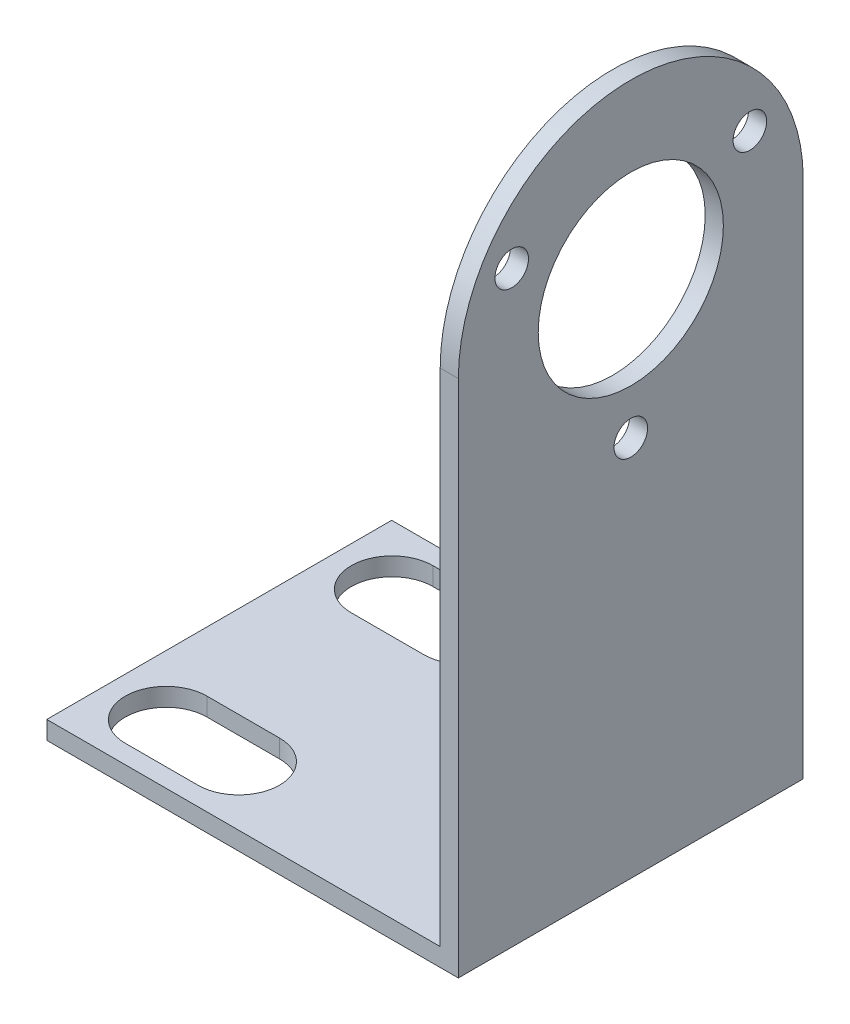
ISO-10303-21;
HEADER;
FILE_DESCRIPTION(('STEP AP214'),'2;1');
FILE_NAME('part.step','',(''),(''),'','','');
FILE_SCHEMA(('AUTOMOTIVE_DESIGN { 1 0 10303 214 1 1 1 1 }'));
ENDSEC;
DATA;
#1=APPLICATION_CONTEXT('core data for automotive mechanical design processes');
#2=APPLICATION_PROTOCOL_DEFINITION('international standard','automotive_design',2000,#1);
#3=PRODUCT_CONTEXT('',#1,'mechanical');
#4=PRODUCT('Part','Part','',(#3));
#5=PRODUCT_RELATED_PRODUCT_CATEGORY('part','',(#4));
#6=PRODUCT_DEFINITION_FORMATION('','',#4);
#7=PRODUCT_DEFINITION_CONTEXT('part definition',#1,'design');
#8=PRODUCT_DEFINITION('design','',#6,#7);
#9=PRODUCT_DEFINITION_SHAPE('','',#8);
#10=(LENGTH_UNIT() NAMED_UNIT(*) SI_UNIT(.MILLI.,.METRE.));
#11=(NAMED_UNIT(*) PLANE_ANGLE_UNIT() SI_UNIT($,.RADIAN.));
#12=(NAMED_UNIT(*) SI_UNIT($,.STERADIAN.) SOLID_ANGLE_UNIT());
#13=UNCERTAINTY_MEASURE_WITH_UNIT(LENGTH_MEASURE(1.E-05),#10,'distance_accuracy_value','');
#14=(GEOMETRIC_REPRESENTATION_CONTEXT(3) GLOBAL_UNCERTAINTY_ASSIGNED_CONTEXT((#13)) GLOBAL_UNIT_ASSIGNED_CONTEXT((#10,
#11,#12)) REPRESENTATION_CONTEXT('',''));
#15=CARTESIAN_POINT('',(0.,0.,0.));
#16=DIRECTION('',(0.,0.,1.));
#17=DIRECTION('',(1.,0.,0.));
#18=AXIS2_PLACEMENT_3D('',#15,#16,#17);
#19=CARTESIAN_POINT('',(-45.35,2.,-21.9762845849803));
#20=DIRECTION('',(1.,0.,0.));
#21=DIRECTION('',(0.,0.,-1.));
#22=AXIS2_PLACEMENT_3D('',#19,#20,#21);
#23=PLANE('',#22);
#24=DIRECTION('',(0.,0.,1.));
#25=VECTOR('',#24,1.);
#26=CARTESIAN_POINT('',(-45.35,0.,-21.9762845849803));
#27=LINE('',#26,#25);
#28=CARTESIAN_POINT('',(-45.35,0.,-21.9762845849803));
#29=VERTEX_POINT('',#28);
#30=CARTESIAN_POINT('',(-45.35,0.,16.0237154150197));
#31=VERTEX_POINT('',#30);
#32=EDGE_CURVE('E247',#29,#31,#27,.T.);
#33=ORIENTED_EDGE('',*,*,#32,.T.);
#34=DIRECTION('',(0.,-1.,0.));
#35=VECTOR('',#34,1.);
#36=CARTESIAN_POINT('',(-45.35,2.,16.0237154150197));
#37=LINE('',#36,#35);
#38=CARTESIAN_POINT('',(-45.35,2.,16.0237154150197));
#39=VERTEX_POINT('',#38);
#40=EDGE_CURVE('E47',#39,#31,#37,.T.);
#41=ORIENTED_EDGE('',*,*,#40,.F.);
#42=DIRECTION('',(0.,0.,1.));
#43=VECTOR('',#42,1.);
#44=CARTESIAN_POINT('',(-45.35,2.,-21.9762845849803));
#45=LINE('',#44,#43);
#46=CARTESIAN_POINT('',(-45.35,2.,-21.9762845849803));
#47=VERTEX_POINT('',#46);
#48=EDGE_CURVE('E248',#47,#39,#45,.T.);
#49=ORIENTED_EDGE('',*,*,#48,.F.);
#50=DIRECTION('',(0.,-1.,0.));
#51=VECTOR('',#50,1.);
#52=CARTESIAN_POINT('',(-45.35,2.,-21.9762845849803));
#53=LINE('',#52,#51);
#54=EDGE_CURVE('E258',#47,#29,#53,.T.);
#55=ORIENTED_EDGE('',*,*,#54,.T.);
#56=EDGE_LOOP('',(#33,#41,#49,#55));
#57=FACE_BOUND('',#56,.T.);
#58=ADVANCED_FACE('F40',(#57),#23,.F.);
#59=CARTESIAN_POINT('',(-45.35,2.,16.0237154150197));
#60=DIRECTION('',(0.,0.,-1.));
#61=DIRECTION('',(-1.,0.,0.));
#62=AXIS2_PLACEMENT_3D('',#59,#60,#61);
#63=PLANE('',#62);
#64=DIRECTION('',(0.,-1.,0.));
#65=VECTOR('',#64,1.);
#66=CARTESIAN_POINT('',(0.,2.,16.0237154150197));
#67=LINE('',#66,#65);
#68=CARTESIAN_POINT('',(0.,57.2,16.0237154150197));
#69=VERTEX_POINT('',#68);
#70=CARTESIAN_POINT('',(0.,0.,16.0237154150197));
#71=VERTEX_POINT('',#70);
#72=EDGE_CURVE('E272',#69,#71,#67,.T.);
#73=ORIENTED_EDGE('',*,*,#72,.F.);
#74=DIRECTION('',(1.,0.,0.));
#75=VECTOR('',#74,1.);
#76=CARTESIAN_POINT('',(-45.35,57.2,16.0237154150197));
#77=LINE('',#76,#75);
#78=CARTESIAN_POINT('',(-1.99999999999999,57.2,16.0237154150197));
#79=VERTEX_POINT('',#78);
#80=EDGE_CURVE('E212',#79,#69,#77,.T.);
#81=ORIENTED_EDGE('',*,*,#80,.F.);
#82=DIRECTION('',(0.,-1.,0.));
#83=VECTOR('',#82,1.);
#84=CARTESIAN_POINT('',(-1.99999999999999,76.25,16.0237154150197));
#85=LINE('',#84,#83);
#86=CARTESIAN_POINT('',(-1.99999999999999,2.,16.0237154150197));
#87=VERTEX_POINT('',#86);
#88=EDGE_CURVE('E243',#79,#87,#85,.T.);
#89=ORIENTED_EDGE('',*,*,#88,.T.);
#90=DIRECTION('',(1.,0.,0.));
#91=VECTOR('',#90,1.);
#92=CARTESIAN_POINT('',(-45.35,2.,16.0237154150197));
#93=LINE('',#92,#91);
#94=EDGE_CURVE('E251',#39,#87,#93,.T.);
#95=ORIENTED_EDGE('',*,*,#94,.F.);
#96=ORIENTED_EDGE('',*,*,#40,.T.);
#97=DIRECTION('',(1.,0.,0.));
#98=VECTOR('',#97,1.);
#99=CARTESIAN_POINT('',(-45.35,0.,16.0237154150197));
#100=LINE('',#99,#98);
#101=EDGE_CURVE('E261',#31,#71,#100,.T.);
#102=ORIENTED_EDGE('',*,*,#101,.T.);
#103=EDGE_LOOP('',(#73,#81,#89,#95,#96,#102));
#104=FACE_BOUND('',#103,.T.);
#105=ADVANCED_FACE('F277',(#104),#63,.F.);
#106=CARTESIAN_POINT('',(0.,2.,-21.9762845849803));
#107=DIRECTION('',(1.,0.,0.));
#108=DIRECTION('',(0.,0.,-1.));
#109=AXIS2_PLACEMENT_3D('',#106,#107,#108);
#110=PLANE('',#109);
#111=CARTESIAN_POINT('',(0.,57.2,-2.97628458498026));
#112=DIRECTION('',(-1.,0.,0.));
#113=DIRECTION('',(0.,0.,-1.));
#114=AXIS2_PLACEMENT_3D('',#111,#112,#113);
#115=CIRCLE('',#114,19.);
#116=CARTESIAN_POINT('',(0.,57.2,-21.9762845849803));
#117=VERTEX_POINT('',#116);
#118=EDGE_CURVE('E176',#69,#117,#115,.T.);
#119=ORIENTED_EDGE('',*,*,#118,.F.);
#120=ORIENTED_EDGE('',*,*,#72,.T.);
#121=DIRECTION('',(0.,0.,1.));
#122=VECTOR('',#121,1.);
#123=CARTESIAN_POINT('',(0.,0.,-21.9762845849803));
#124=LINE('',#123,#122);
#125=CARTESIAN_POINT('',(0.,0.,-21.9762845849803));
#126=VERTEX_POINT('',#125);
#127=EDGE_CURVE('E264',#126,#71,#124,.T.);
#128=ORIENTED_EDGE('',*,*,#127,.F.);
#129=DIRECTION('',(0.,-1.,0.));
#130=VECTOR('',#129,1.);
#131=CARTESIAN_POINT('',(0.,2.,-21.9762845849803));
#132=LINE('',#131,#130);
#133=EDGE_CURVE('E270',#117,#126,#132,.T.);
#134=ORIENTED_EDGE('',*,*,#133,.F.);
#135=EDGE_LOOP('',(#119,#120,#128,#134));
#136=FACE_BOUND('',#135,.T.);
#137=CARTESIAN_POINT('',(0.,42.05,-2.97628458498026));
#138=DIRECTION('',(1.,0.,0.));
#139=DIRECTION('',(0.,0.,-1.));
#140=AXIS2_PLACEMENT_3D('',#137,#138,#139);
#141=CIRCLE('',#140,1.85);
#142=CARTESIAN_POINT('',(0.,42.05,-4.82628458498026));
#143=VERTEX_POINT('',#142);
#144=EDGE_CURVE('E237',#143,#143,#141,.T.);
#145=ORIENTED_EDGE('',*,*,#144,.F.);
#146=EDGE_LOOP('',(#145));
#147=FACE_BOUND('',#146,.T.);
#148=CARTESIAN_POINT('',(0.,64.7750000000001,10.144000282354));
#149=DIRECTION('',(1.,0.,0.));
#150=DIRECTION('',(0.,0.,-1.));
#151=AXIS2_PLACEMENT_3D('',#148,#149,#150);
#152=CIRCLE('',#151,1.85);
#153=CARTESIAN_POINT('',(0.,64.7750000000001,8.29400028235395));
#154=VERTEX_POINT('',#153);
#155=EDGE_CURVE('E234',#154,#154,#152,.T.);
#156=ORIENTED_EDGE('',*,*,#155,.F.);
#157=EDGE_LOOP('',(#156));
#158=FACE_BOUND('',#157,.T.);
#159=CARTESIAN_POINT('',(0.,64.7749999999999,-16.0965694523146));
#160=DIRECTION('',(1.,0.,0.));
#161=DIRECTION('',(0.,0.,-1.));
#162=AXIS2_PLACEMENT_3D('',#159,#160,#161);
#163=CIRCLE('',#162,1.85);
#164=CARTESIAN_POINT('',(0.,64.7749999999999,-17.9465694523146));
#165=VERTEX_POINT('',#164);
#166=EDGE_CURVE('E231',#165,#165,#163,.T.);
#167=ORIENTED_EDGE('',*,*,#166,.F.);
#168=EDGE_LOOP('',(#167));
#169=FACE_BOUND('',#168,.T.);
#170=CARTESIAN_POINT('',(0.,57.2,-2.97628458498026));
#171=DIRECTION('',(1.,0.,0.));
#172=DIRECTION('',(0.,0.,-1.));
#173=AXIS2_PLACEMENT_3D('',#170,#171,#172);
#174=CIRCLE('',#173,10.2);
#175=CARTESIAN_POINT('',(0.,57.2,-13.1762845849803));
#176=VERTEX_POINT('',#175);
#177=EDGE_CURVE('E228',#176,#176,#174,.T.);
#178=ORIENTED_EDGE('',*,*,#177,.F.);
#179=EDGE_LOOP('',(#178));
#180=FACE_BOUND('',#179,.T.);
#181=ADVANCED_FACE('F290',(#136,#147,#158,#169,#180),#110,.T.);
#182=CARTESIAN_POINT('',(-45.35,2.,-21.9762845849803));
#183=DIRECTION('',(0.,0.,-1.));
#184=DIRECTION('',(-1.,0.,0.));
#185=AXIS2_PLACEMENT_3D('',#182,#183,#184);
#186=PLANE('',#185);
#187=DIRECTION('',(1.,0.,0.));
#188=VECTOR('',#187,1.);
#189=CARTESIAN_POINT('',(-45.35,57.2,-21.9762845849803));
#190=LINE('',#189,#188);
#191=CARTESIAN_POINT('',(-2.,57.2,-21.9762845849803));
#192=VERTEX_POINT('',#191);
#193=EDGE_CURVE('E211',#192,#117,#190,.T.);
#194=ORIENTED_EDGE('',*,*,#193,.T.);
#195=ORIENTED_EDGE('',*,*,#133,.T.);
#196=DIRECTION('',(1.,0.,0.));
#197=VECTOR('',#196,1.);
#198=CARTESIAN_POINT('',(-45.35,0.,-21.9762845849803));
#199=LINE('',#198,#197);
#200=EDGE_CURVE('E252',#29,#126,#199,.T.);
#201=ORIENTED_EDGE('',*,*,#200,.F.);
#202=ORIENTED_EDGE('',*,*,#54,.F.);
#203=DIRECTION('',(1.,0.,0.));
#204=VECTOR('',#203,1.);
#205=CARTESIAN_POINT('',(-45.35,2.,-21.9762845849803));
#206=LINE('',#205,#204);
#207=CARTESIAN_POINT('',(-1.99999999999999,2.,-21.9762845849803));
#208=VERTEX_POINT('',#207);
#209=EDGE_CURVE('E255',#47,#208,#206,.T.);
#210=ORIENTED_EDGE('',*,*,#209,.T.);
#211=DIRECTION('',(0.,-1.,0.));
#212=VECTOR('',#211,1.);
#213=CARTESIAN_POINT('',(-2.,76.25,-21.9762845849803));
#214=LINE('',#213,#212);
#215=EDGE_CURVE('E245',#192,#208,#214,.T.);
#216=ORIENTED_EDGE('',*,*,#215,.F.);
#217=EDGE_LOOP('',(#194,#195,#201,#202,#210,#216));
#218=FACE_BOUND('',#217,.T.);
#219=ADVANCED_FACE('F284',(#218),#186,.T.);
#220=CARTESIAN_POINT('',(0.,2.,0.));
#221=DIRECTION('',(0.,1.,0.));
#222=DIRECTION('',(0.,0.,1.));
#223=AXIS2_PLACEMENT_3D('',#220,#221,#222);
#224=PLANE('',#223);
#225=CARTESIAN_POINT('',(-30.75,2.,9.47371541501974));
#226=DIRECTION('',(0.,1.,0.));
#227=DIRECTION('',(0.,0.,1.));
#228=AXIS2_PLACEMENT_3D('',#225,#226,#227);
#229=CIRCLE('',#228,4.5);
#230=CARTESIAN_POINT('',(-30.75,2.,13.9737154150197));
#231=VERTEX_POINT('',#230);
#232=CARTESIAN_POINT('',(-30.75,2.,4.97371541501974));
#233=VERTEX_POINT('',#232);
#234=EDGE_CURVE('E54',#231,#233,#229,.T.);
#235=ORIENTED_EDGE('',*,*,#234,.F.);
#236=DIRECTION('',(1.,0.,0.));
#237=VECTOR('',#236,1.);
#238=CARTESIAN_POINT('',(-30.75,2.,13.9737154150197));
#239=LINE('',#238,#237);
#240=CARTESIAN_POINT('',(-38.75,2.,13.9737154150197));
#241=VERTEX_POINT('',#240);
#242=EDGE_CURVE('E161',#241,#231,#239,.T.);
#243=ORIENTED_EDGE('',*,*,#242,.F.);
#244=CARTESIAN_POINT('',(-38.75,2.,9.47371541501974));
#245=DIRECTION('',(0.,1.,0.));
#246=DIRECTION('',(0.,0.,1.));
#247=AXIS2_PLACEMENT_3D('',#244,#245,#246);
#248=CIRCLE('',#247,4.5);
#249=CARTESIAN_POINT('',(-38.75,2.,4.97371541501974));
#250=VERTEX_POINT('',#249);
#251=EDGE_CURVE('E164',#250,#241,#248,.T.);
#252=ORIENTED_EDGE('',*,*,#251,.F.);
#253=DIRECTION('',(-1.,0.,0.));
#254=VECTOR('',#253,1.);
#255=CARTESIAN_POINT('',(-30.75,2.,4.97371541501974));
#256=LINE('',#255,#254);
#257=EDGE_CURVE('E170',#233,#250,#256,.T.);
#258=ORIENTED_EDGE('',*,*,#257,.F.);
#259=EDGE_LOOP('',(#235,#243,#252,#258));
#260=FACE_BOUND('',#259,.T.);
#261=CARTESIAN_POINT('',(-30.75,2.,-15.4262845849803));
#262=DIRECTION('',(0.,1.,0.));
#263=DIRECTION('',(0.,0.,-1.));
#264=AXIS2_PLACEMENT_3D('',#261,#262,#263);
#265=CIRCLE('',#264,4.5);
#266=CARTESIAN_POINT('',(-30.75,2.,-10.9262845849803));
#267=VERTEX_POINT('',#266);
#268=CARTESIAN_POINT('',(-30.75,2.,-19.9262845849803));
#269=VERTEX_POINT('',#268);
#270=EDGE_CURVE('E62',#267,#269,#265,.T.);
#271=ORIENTED_EDGE('',*,*,#270,.F.);
#272=DIRECTION('',(1.,0.,0.));
#273=VECTOR('',#272,1.);
#274=CARTESIAN_POINT('',(-30.75,2.,-10.9262845849803));
#275=LINE('',#274,#273);
#276=CARTESIAN_POINT('',(-38.75,2.,-10.9262845849803));
#277=VERTEX_POINT('',#276);
#278=EDGE_CURVE('E189',#277,#267,#275,.T.);
#279=ORIENTED_EDGE('',*,*,#278,.F.);
#280=CARTESIAN_POINT('',(-38.75,2.,-15.4262845849803));
#281=DIRECTION('',(0.,1.,0.));
#282=DIRECTION('',(0.,0.,-1.));
#283=AXIS2_PLACEMENT_3D('',#280,#281,#282);
#284=CIRCLE('',#283,4.5);
#285=CARTESIAN_POINT('',(-38.75,2.,-19.9262845849803));
#286=VERTEX_POINT('',#285);
#287=EDGE_CURVE('E192',#286,#277,#284,.T.);
#288=ORIENTED_EDGE('',*,*,#287,.F.);
#289=DIRECTION('',(-1.,0.,0.));
#290=VECTOR('',#289,1.);
#291=CARTESIAN_POINT('',(-30.75,2.,-19.9262845849803));
#292=LINE('',#291,#290);
#293=EDGE_CURVE('E196',#269,#286,#292,.T.);
#294=ORIENTED_EDGE('',*,*,#293,.F.);
#295=EDGE_LOOP('',(#271,#279,#288,#294));
#296=FACE_BOUND('',#295,.T.);
#297=DIRECTION('',(0.,0.,1.));
#298=VECTOR('',#297,1.);
#299=CARTESIAN_POINT('',(-2.,2.,-21.9762845849803));
#300=LINE('',#299,#298);
#301=EDGE_CURVE('E240',#208,#87,#300,.T.);
#302=ORIENTED_EDGE('',*,*,#301,.F.);
#303=ORIENTED_EDGE('',*,*,#209,.F.);
#304=ORIENTED_EDGE('',*,*,#48,.T.);
#305=ORIENTED_EDGE('',*,*,#94,.T.);
#306=EDGE_LOOP('',(#302,#303,#304,#305));
#307=FACE_BOUND('',#306,.T.);
#308=ADVANCED_FACE('F300',(#260,#296,#307),#224,.T.);
#309=CARTESIAN_POINT('',(0.,0.,0.));
#310=DIRECTION('',(0.,1.,0.));
#311=DIRECTION('',(0.,0.,1.));
#312=AXIS2_PLACEMENT_3D('',#309,#310,#311);
#313=PLANE('',#312);
#314=DIRECTION('',(1.,0.,0.));
#315=VECTOR('',#314,1.);
#316=CARTESIAN_POINT('',(-30.75,0.,13.9737154150197));
#317=LINE('',#316,#315);
#318=CARTESIAN_POINT('',(-38.75,0.,13.9737154150197));
#319=VERTEX_POINT('',#318);
#320=CARTESIAN_POINT('',(-30.75,0.,13.9737154150197));
#321=VERTEX_POINT('',#320);
#322=EDGE_CURVE('E148',#319,#321,#317,.T.);
#323=ORIENTED_EDGE('',*,*,#322,.T.);
#324=CARTESIAN_POINT('',(-30.75,0.,9.47371541501974));
#325=DIRECTION('',(0.,1.,0.));
#326=DIRECTION('',(0.,0.,1.));
#327=AXIS2_PLACEMENT_3D('',#324,#325,#326);
#328=CIRCLE('',#327,4.5);
#329=CARTESIAN_POINT('',(-30.75,0.,4.97371541501974));
#330=VERTEX_POINT('',#329);
#331=EDGE_CURVE('E142',#321,#330,#328,.T.);
#332=ORIENTED_EDGE('',*,*,#331,.T.);
#333=DIRECTION('',(-1.,0.,0.));
#334=VECTOR('',#333,1.);
#335=CARTESIAN_POINT('',(-30.75,0.,4.97371541501974));
#336=LINE('',#335,#334);
#337=CARTESIAN_POINT('',(-38.75,0.,4.97371541501974));
#338=VERTEX_POINT('',#337);
#339=EDGE_CURVE('E152',#330,#338,#336,.T.);
#340=ORIENTED_EDGE('',*,*,#339,.T.);
#341=CARTESIAN_POINT('',(-38.75,0.,9.47371541501974));
#342=DIRECTION('',(0.,1.,0.));
#343=DIRECTION('',(0.,0.,1.));
#344=AXIS2_PLACEMENT_3D('',#341,#342,#343);
#345=CIRCLE('',#344,4.5);
#346=EDGE_CURVE('E156',#338,#319,#345,.T.);
#347=ORIENTED_EDGE('',*,*,#346,.T.);
#348=EDGE_LOOP('',(#323,#332,#340,#347));
#349=FACE_BOUND('',#348,.T.);
#350=DIRECTION('',(1.,0.,0.));
#351=VECTOR('',#350,1.);
#352=CARTESIAN_POINT('',(-30.75,0.,-10.9262845849803));
#353=LINE('',#352,#351);
#354=CARTESIAN_POINT('',(-38.75,0.,-10.9262845849803));
#355=VERTEX_POINT('',#354);
#356=CARTESIAN_POINT('',(-30.75,0.,-10.9262845849803));
#357=VERTEX_POINT('',#356);
#358=EDGE_CURVE('E182',#355,#357,#353,.T.);
#359=ORIENTED_EDGE('',*,*,#358,.T.);
#360=CARTESIAN_POINT('',(-30.75,0.,-15.4262845849803));
#361=DIRECTION('',(0.,1.,0.));
#362=DIRECTION('',(0.,0.,-1.));
#363=AXIS2_PLACEMENT_3D('',#360,#361,#362);
#364=CIRCLE('',#363,4.5);
#365=CARTESIAN_POINT('',(-30.75,0.,-19.9262845849803));
#366=VERTEX_POINT('',#365);
#367=EDGE_CURVE('E193',#357,#366,#364,.T.);
#368=ORIENTED_EDGE('',*,*,#367,.T.);
#369=DIRECTION('',(-1.,0.,0.));
#370=VECTOR('',#369,1.);
#371=CARTESIAN_POINT('',(-30.75,0.,-19.9262845849803));
#372=LINE('',#371,#370);
#373=CARTESIAN_POINT('',(-38.75,0.,-19.9262845849803));
#374=VERTEX_POINT('',#373);
#375=EDGE_CURVE('E205',#366,#374,#372,.T.);
#376=ORIENTED_EDGE('',*,*,#375,.T.);
#377=CARTESIAN_POINT('',(-38.75,0.,-15.4262845849803));
#378=DIRECTION('',(0.,1.,0.));
#379=DIRECTION('',(0.,0.,-1.));
#380=AXIS2_PLACEMENT_3D('',#377,#378,#379);
#381=CIRCLE('',#380,4.5);
#382=EDGE_CURVE('E202',#374,#355,#381,.T.);
#383=ORIENTED_EDGE('',*,*,#382,.T.);
#384=EDGE_LOOP('',(#359,#368,#376,#383));
#385=FACE_BOUND('',#384,.T.);
#386=ORIENTED_EDGE('',*,*,#32,.F.);
#387=ORIENTED_EDGE('',*,*,#200,.T.);
#388=ORIENTED_EDGE('',*,*,#127,.T.);
#389=ORIENTED_EDGE('',*,*,#101,.F.);
#390=EDGE_LOOP('',(#386,#387,#388,#389));
#391=FACE_BOUND('',#390,.T.);
#392=ADVANCED_FACE('F158',(#349,#385,#391),#313,.F.);
#393=CARTESIAN_POINT('',(-2.,76.25,-21.9762845849803));
#394=DIRECTION('',(1.,0.,0.));
#395=DIRECTION('',(0.,0.,-1.));
#396=AXIS2_PLACEMENT_3D('',#393,#394,#395);
#397=PLANE('',#396);
#398=CARTESIAN_POINT('',(-2.,42.05,-2.97628458498026));
#399=DIRECTION('',(-1.,0.,0.));
#400=DIRECTION('',(0.,0.,1.));
#401=AXIS2_PLACEMENT_3D('',#398,#399,#400);
#402=CIRCLE('',#401,1.85);
#403=CARTESIAN_POINT('',(-2.,42.05,-1.12628458498026));
#404=VERTEX_POINT('',#403);
#405=EDGE_CURVE('E214',#404,#404,#402,.T.);
#406=ORIENTED_EDGE('',*,*,#405,.F.);
#407=EDGE_LOOP('',(#406));
#408=FACE_BOUND('',#407,.T.);
#409=CARTESIAN_POINT('',(-2.,64.7750000000001,10.144000282354));
#410=DIRECTION('',(-1.,0.,0.));
#411=DIRECTION('',(0.,0.,1.));
#412=AXIS2_PLACEMENT_3D('',#409,#410,#411);
#413=CIRCLE('',#412,1.85);
#414=CARTESIAN_POINT('',(-2.,64.7750000000001,11.9940002823539));
#415=VERTEX_POINT('',#414);
#416=EDGE_CURVE('E221',#415,#415,#413,.T.);
#417=ORIENTED_EDGE('',*,*,#416,.F.);
#418=EDGE_LOOP('',(#417));
#419=FACE_BOUND('',#418,.T.);
#420=CARTESIAN_POINT('',(-2.,64.7749999999999,-16.0965694523146));
#421=DIRECTION('',(-1.,0.,0.));
#422=DIRECTION('',(0.,0.,1.));
#423=AXIS2_PLACEMENT_3D('',#420,#421,#422);
#424=CIRCLE('',#423,1.85);
#425=CARTESIAN_POINT('',(-2.,64.7749999999999,-14.2465694523146));
#426=VERTEX_POINT('',#425);
#427=EDGE_CURVE('E217',#426,#426,#424,.T.);
#428=ORIENTED_EDGE('',*,*,#427,.F.);
#429=EDGE_LOOP('',(#428));
#430=FACE_BOUND('',#429,.T.);
#431=CARTESIAN_POINT('',(-2.,57.2,-2.97628458498026));
#432=DIRECTION('',(-1.,0.,0.));
#433=DIRECTION('',(0.,0.,1.));
#434=AXIS2_PLACEMENT_3D('',#431,#432,#433);
#435=CIRCLE('',#434,10.2);
#436=CARTESIAN_POINT('',(-2.,57.2,7.22371541501974));
#437=VERTEX_POINT('',#436);
#438=EDGE_CURVE('E220',#437,#437,#435,.T.);
#439=ORIENTED_EDGE('',*,*,#438,.F.);
#440=EDGE_LOOP('',(#439));
#441=FACE_BOUND('',#440,.T.);
#442=ORIENTED_EDGE('',*,*,#88,.F.);
#443=CARTESIAN_POINT('',(-2.,57.2,-2.97628458498026));
#444=DIRECTION('',(1.,0.,0.));
#445=DIRECTION('',(0.,0.,-1.));
#446=AXIS2_PLACEMENT_3D('',#443,#444,#445);
#447=CIRCLE('',#446,19.);
#448=EDGE_CURVE('E11',#79,#192,#447,.F.);
#449=ORIENTED_EDGE('',*,*,#448,.T.);
#450=ORIENTED_EDGE('',*,*,#215,.T.);
#451=ORIENTED_EDGE('',*,*,#301,.T.);
#452=EDGE_LOOP('',(#442,#449,#450,#451));
#453=FACE_BOUND('',#452,.T.);
#454=ADVANCED_FACE('F296',(#408,#419,#430,#441,#453),#397,.F.);
#455=CARTESIAN_POINT('',(48.,57.2,-2.97628458498027));
#456=DIRECTION('',(-1.,0.,0.));
#457=DIRECTION('',(0.,0.,1.));
#458=AXIS2_PLACEMENT_3D('',#455,#456,#457);
#459=CYLINDRICAL_SURFACE('',#458,10.2);
#460=ORIENTED_EDGE('',*,*,#177,.T.);
#461=EDGE_LOOP('',(#460));
#462=FACE_BOUND('',#461,.T.);
#463=ORIENTED_EDGE('',*,*,#438,.T.);
#464=EDGE_LOOP('',(#463));
#465=FACE_BOUND('',#464,.T.);
#466=ADVANCED_FACE('F347',(#462,#465),#459,.F.);
#467=CARTESIAN_POINT('',(48.,64.7749999999999,-16.0965694523146));
#468=DIRECTION('',(-1.,0.,0.));
#469=DIRECTION('',(0.,0.,1.));
#470=AXIS2_PLACEMENT_3D('',#467,#468,#469);
#471=CYLINDRICAL_SURFACE('',#470,1.85);
#472=ORIENTED_EDGE('',*,*,#166,.T.);
#473=EDGE_LOOP('',(#472));
#474=FACE_BOUND('',#473,.T.);
#475=ORIENTED_EDGE('',*,*,#427,.T.);
#476=EDGE_LOOP('',(#475));
#477=FACE_BOUND('',#476,.T.);
#478=ADVANCED_FACE('F356',(#474,#477),#471,.F.);
#479=CARTESIAN_POINT('',(48.,64.7750000000001,10.1440002823539));
#480=DIRECTION('',(-1.,0.,0.));
#481=DIRECTION('',(0.,0.,1.));
#482=AXIS2_PLACEMENT_3D('',#479,#480,#481);
#483=CYLINDRICAL_SURFACE('',#482,1.85);
#484=ORIENTED_EDGE('',*,*,#155,.T.);
#485=EDGE_LOOP('',(#484));
#486=FACE_BOUND('',#485,.T.);
#487=ORIENTED_EDGE('',*,*,#416,.T.);
#488=EDGE_LOOP('',(#487));
#489=FACE_BOUND('',#488,.T.);
#490=ADVANCED_FACE('F367',(#486,#489),#483,.F.);
#491=CARTESIAN_POINT('',(48.,42.05,-2.97628458498026));
#492=DIRECTION('',(-1.,0.,0.));
#493=DIRECTION('',(0.,0.,1.));
#494=AXIS2_PLACEMENT_3D('',#491,#492,#493);
#495=CYLINDRICAL_SURFACE('',#494,1.85);
#496=ORIENTED_EDGE('',*,*,#144,.T.);
#497=EDGE_LOOP('',(#496));
#498=FACE_BOUND('',#497,.T.);
#499=ORIENTED_EDGE('',*,*,#405,.T.);
#500=EDGE_LOOP('',(#499));
#501=FACE_BOUND('',#500,.T.);
#502=ADVANCED_FACE('F377',(#498,#501),#495,.F.);
#503=CARTESIAN_POINT('',(-45.35,57.2,-2.97628458498026));
#504=DIRECTION('',(1.,0.,0.));
#505=DIRECTION('',(0.,0.,-1.));
#506=AXIS2_PLACEMENT_3D('',#503,#504,#505);
#507=CYLINDRICAL_SURFACE('',#506,19.);
#508=ORIENTED_EDGE('',*,*,#80,.T.);
#509=ORIENTED_EDGE('',*,*,#118,.T.);
#510=ORIENTED_EDGE('',*,*,#193,.F.);
#511=ORIENTED_EDGE('',*,*,#448,.F.);
#512=EDGE_LOOP('',(#508,#509,#510,#511));
#513=FACE_BOUND('',#512,.T.);
#514=ADVANCED_FACE('F387',(#513),#507,.T.);
#515=CARTESIAN_POINT('',(-30.75,0.,-15.4262845849803));
#516=DIRECTION('',(0.,1.,0.));
#517=DIRECTION('',(0.,0.,1.));
#518=AXIS2_PLACEMENT_3D('',#515,#516,#517);
#519=CYLINDRICAL_SURFACE('',#518,4.5);
#520=ORIENTED_EDGE('',*,*,#270,.T.);
#521=DIRECTION('',(0.,1.,0.));
#522=VECTOR('',#521,1.);
#523=CARTESIAN_POINT('',(-30.75,0.,-19.9262845849803));
#524=LINE('',#523,#522);
#525=EDGE_CURVE('E180',#366,#269,#524,.T.);
#526=ORIENTED_EDGE('',*,*,#525,.F.);
#527=ORIENTED_EDGE('',*,*,#367,.F.);
#528=DIRECTION('',(0.,1.,0.));
#529=VECTOR('',#528,1.);
#530=CARTESIAN_POINT('',(-30.75,0.,-10.9262845849803));
#531=LINE('',#530,#529);
#532=EDGE_CURVE('E187',#357,#267,#531,.T.);
#533=ORIENTED_EDGE('',*,*,#532,.T.);
#534=EDGE_LOOP('',(#520,#526,#527,#533));
#535=FACE_BOUND('',#534,.T.);
#536=ADVANCED_FACE('F397',(#535),#519,.F.);
#537=CARTESIAN_POINT('',(-30.75,0.,-10.9262845849803));
#538=DIRECTION('',(0.,0.,1.));
#539=DIRECTION('',(1.,0.,0.));
#540=AXIS2_PLACEMENT_3D('',#537,#538,#539);
#541=PLANE('',#540);
#542=ORIENTED_EDGE('',*,*,#278,.T.);
#543=ORIENTED_EDGE('',*,*,#532,.F.);
#544=ORIENTED_EDGE('',*,*,#358,.F.);
#545=DIRECTION('',(0.,1.,0.));
#546=VECTOR('',#545,1.);
#547=CARTESIAN_POINT('',(-38.75,0.,-10.9262845849803));
#548=LINE('',#547,#546);
#549=EDGE_CURVE('E185',#355,#277,#548,.T.);
#550=ORIENTED_EDGE('',*,*,#549,.T.);
#551=EDGE_LOOP('',(#542,#543,#544,#550));
#552=FACE_BOUND('',#551,.T.);
#553=ADVANCED_FACE('F405',(#552),#541,.F.);
#554=CARTESIAN_POINT('',(-38.75,0.,-15.4262845849803));
#555=DIRECTION('',(0.,1.,0.));
#556=DIRECTION('',(0.,0.,1.));
#557=AXIS2_PLACEMENT_3D('',#554,#555,#556);
#558=CYLINDRICAL_SURFACE('',#557,4.5);
#559=ORIENTED_EDGE('',*,*,#287,.T.);
#560=ORIENTED_EDGE('',*,*,#549,.F.);
#561=ORIENTED_EDGE('',*,*,#382,.F.);
#562=DIRECTION('',(0.,1.,0.));
#563=VECTOR('',#562,1.);
#564=CARTESIAN_POINT('',(-38.75,0.,-19.9262845849803));
#565=LINE('',#564,#563);
#566=EDGE_CURVE('E183',#374,#286,#565,.T.);
#567=ORIENTED_EDGE('',*,*,#566,.T.);
#568=EDGE_LOOP('',(#559,#560,#561,#567));
#569=FACE_BOUND('',#568,.T.);
#570=ADVANCED_FACE('F414',(#569),#558,.F.);
#571=CARTESIAN_POINT('',(-30.75,0.,-19.9262845849803));
#572=DIRECTION('',(0.,0.,-1.));
#573=DIRECTION('',(-1.,0.,0.));
#574=AXIS2_PLACEMENT_3D('',#571,#572,#573);
#575=PLANE('',#574);
#576=ORIENTED_EDGE('',*,*,#293,.T.);
#577=ORIENTED_EDGE('',*,*,#566,.F.);
#578=ORIENTED_EDGE('',*,*,#375,.F.);
#579=ORIENTED_EDGE('',*,*,#525,.T.);
#580=EDGE_LOOP('',(#576,#577,#578,#579));
#581=FACE_BOUND('',#580,.T.);
#582=ADVANCED_FACE('F424',(#581),#575,.F.);
#583=CARTESIAN_POINT('',(-30.75,0.,9.47371541501974));
#584=DIRECTION('',(0.,1.,0.));
#585=DIRECTION('',(0.,0.,1.));
#586=AXIS2_PLACEMENT_3D('',#583,#584,#585);
#587=CYLINDRICAL_SURFACE('',#586,4.5);
#588=ORIENTED_EDGE('',*,*,#234,.T.);
#589=DIRECTION('',(0.,1.,0.));
#590=VECTOR('',#589,1.);
#591=CARTESIAN_POINT('',(-30.75,0.,4.97371541501974));
#592=LINE('',#591,#590);
#593=EDGE_CURVE('E138',#330,#233,#592,.T.);
#594=ORIENTED_EDGE('',*,*,#593,.F.);
#595=ORIENTED_EDGE('',*,*,#331,.F.);
#596=DIRECTION('',(0.,1.,0.));
#597=VECTOR('',#596,1.);
#598=CARTESIAN_POINT('',(-30.75,0.,13.9737154150197));
#599=LINE('',#598,#597);
#600=EDGE_CURVE('E174',#321,#231,#599,.T.);
#601=ORIENTED_EDGE('',*,*,#600,.T.);
#602=EDGE_LOOP('',(#588,#594,#595,#601));
#603=FACE_BOUND('',#602,.T.);
#604=ADVANCED_FACE('F140',(#603),#587,.F.);
#605=CARTESIAN_POINT('',(-30.75,0.,13.9737154150197));
#606=DIRECTION('',(0.,0.,1.));
#607=DIRECTION('',(1.,0.,0.));
#608=AXIS2_PLACEMENT_3D('',#605,#606,#607);
#609=PLANE('',#608);
#610=ORIENTED_EDGE('',*,*,#242,.T.);
#611=ORIENTED_EDGE('',*,*,#600,.F.);
#612=ORIENTED_EDGE('',*,*,#322,.F.);
#613=DIRECTION('',(0.,1.,0.));
#614=VECTOR('',#613,1.);
#615=CARTESIAN_POINT('',(-38.75,0.,13.9737154150197));
#616=LINE('',#615,#614);
#617=EDGE_CURVE('E177',#319,#241,#616,.T.);
#618=ORIENTED_EDGE('',*,*,#617,.T.);
#619=EDGE_LOOP('',(#610,#611,#612,#618));
#620=FACE_BOUND('',#619,.T.);
#621=ADVANCED_FACE('F443',(#620),#609,.F.);
#622=CARTESIAN_POINT('',(-38.75,0.,9.47371541501974));
#623=DIRECTION('',(0.,1.,0.));
#624=DIRECTION('',(0.,0.,1.));
#625=AXIS2_PLACEMENT_3D('',#622,#623,#624);
#626=CYLINDRICAL_SURFACE('',#625,4.5);
#627=ORIENTED_EDGE('',*,*,#251,.T.);
#628=ORIENTED_EDGE('',*,*,#617,.F.);
#629=ORIENTED_EDGE('',*,*,#346,.F.);
#630=DIRECTION('',(0.,1.,0.));
#631=VECTOR('',#630,1.);
#632=CARTESIAN_POINT('',(-38.75,0.,4.97371541501974));
#633=LINE('',#632,#631);
#634=EDGE_CURVE('E147',#338,#250,#633,.T.);
#635=ORIENTED_EDGE('',*,*,#634,.T.);
#636=EDGE_LOOP('',(#627,#628,#629,#635));
#637=FACE_BOUND('',#636,.T.);
#638=ADVANCED_FACE('F452',(#637),#626,.F.);
#639=CARTESIAN_POINT('',(-30.75,0.,4.97371541501974));
#640=DIRECTION('',(0.,0.,-1.));
#641=DIRECTION('',(-1.,0.,0.));
#642=AXIS2_PLACEMENT_3D('',#639,#640,#641);
#643=PLANE('',#642);
#644=ORIENTED_EDGE('',*,*,#257,.T.);
#645=ORIENTED_EDGE('',*,*,#634,.F.);
#646=ORIENTED_EDGE('',*,*,#339,.F.);
#647=ORIENTED_EDGE('',*,*,#593,.T.);
#648=EDGE_LOOP('',(#644,#645,#646,#647));
#649=FACE_BOUND('',#648,.T.);
#650=ADVANCED_FACE('F153',(#649),#643,.F.);
#651=CLOSED_SHELL('',(#58,#105,#181,#219,#308,#392,#454,#466,#478,#490,#502,#514,#536,#553,#570,
#582,#604,#621,#638,#650));
#652=MANIFOLD_SOLID_BREP('B2',#651);
#653=ADVANCED_BREP_SHAPE_REPRESENTATION('',(#18,#652),#14);
#654=SHAPE_DEFINITION_REPRESENTATION(#9,#653);
ENDSEC;
END-ISO-10303-21;
